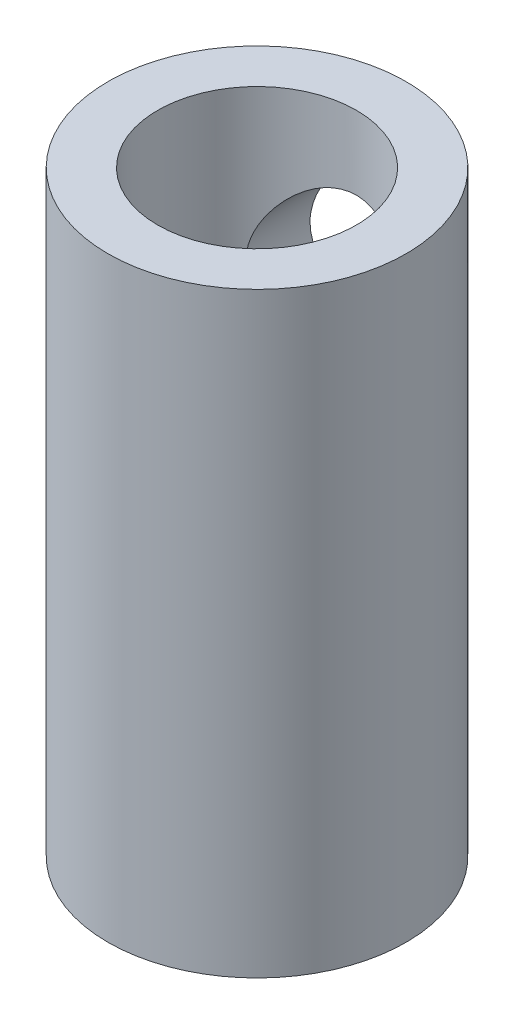
ISO-10303-21;
HEADER;
FILE_DESCRIPTION(('STEP AP214'),'2;1');
FILE_NAME('part.step','',(''),(''),'','','');
FILE_SCHEMA(('AUTOMOTIVE_DESIGN { 1 0 10303 214 1 1 1 1 }'));
ENDSEC;
DATA;
#1=APPLICATION_CONTEXT('core data for automotive mechanical design processes');
#2=APPLICATION_PROTOCOL_DEFINITION('international standard','automotive_design',2000,#1);
#3=PRODUCT_CONTEXT('',#1,'mechanical');
#4=PRODUCT('Part','Part','',(#3));
#5=PRODUCT_RELATED_PRODUCT_CATEGORY('part','',(#4));
#6=PRODUCT_DEFINITION_FORMATION('','',#4);
#7=PRODUCT_DEFINITION_CONTEXT('part definition',#1,'design');
#8=PRODUCT_DEFINITION('design','',#6,#7);
#9=PRODUCT_DEFINITION_SHAPE('','',#8);
#10=(LENGTH_UNIT() NAMED_UNIT(*) SI_UNIT(.MILLI.,.METRE.));
#11=(NAMED_UNIT(*) PLANE_ANGLE_UNIT() SI_UNIT($,.RADIAN.));
#12=(NAMED_UNIT(*) SI_UNIT($,.STERADIAN.) SOLID_ANGLE_UNIT());
#13=UNCERTAINTY_MEASURE_WITH_UNIT(LENGTH_MEASURE(1.E-05),#10,'distance_accuracy_value','');
#14=(GEOMETRIC_REPRESENTATION_CONTEXT(3) GLOBAL_UNCERTAINTY_ASSIGNED_CONTEXT((#13)) GLOBAL_UNIT_ASSIGNED_CONTEXT((#10,
#11,#12)) REPRESENTATION_CONTEXT('',''));
#15=CARTESIAN_POINT('',(0.,0.,0.));
#16=DIRECTION('',(0.,0.,1.));
#17=DIRECTION('',(1.,0.,0.));
#18=AXIS2_PLACEMENT_3D('',#15,#16,#17);
#19=CARTESIAN_POINT('',(0.,19.05,0.));
#20=DIRECTION('',(0.,-1.,0.));
#21=DIRECTION('',(0.,0.,-1.));
#22=AXIS2_PLACEMENT_3D('',#19,#20,#21);
#23=CYLINDRICAL_SURFACE('',#22,4.7625);
#24=CARTESIAN_POINT('',(0.,16.7005,-4.7625));
#25=CARTESIAN_POINT('',(-0.126649169989471,16.7004904991404,-4.76249188012535));
#26=CARTESIAN_POINT('',(-0.253448771240009,16.6904696086063,-4.75739362869145));
#27=CARTESIAN_POINT('',(-0.503284584888762,16.6508319787567,-4.7374986759061));
#28=CARTESIAN_POINT('',(-0.626313472406525,16.6211793513471,-4.72268421315245));
#29=CARTESIAN_POINT('',(-0.864618839509832,16.5437440782188,-4.68490559738032));
#30=CARTESIAN_POINT('',(-0.979923651751686,16.4960325082459,-4.66197341641602));
#31=CARTESIAN_POINT('',(-1.20071351455458,16.3842081989497,-4.61005152679328));
#32=CARTESIAN_POINT('',(-1.30619916940959,16.3200964698421,-4.58106219126309));
#33=CARTESIAN_POINT('',(-1.51166955891755,16.1728046436143,-4.51757958611899));
#34=CARTESIAN_POINT('',(-1.61091451989384,16.0886928212722,-4.48285720856476));
#35=CARTESIAN_POINT('',(-1.79457367080566,15.9057992768856,-4.41255032641904));
#36=CARTESIAN_POINT('',(-1.87897623231331,15.8070061634485,-4.37696517049107));
#37=CARTESIAN_POINT('',(-2.0373472926855,15.5880635759747,-4.30566577380489));
#38=CARTESIAN_POINT('',(-2.1099366693159,15.4668368942104,-4.27016993289307));
#39=CARTESIAN_POINT('',(-2.23339117146114,15.2119167320909,-4.20692439448885));
#40=CARTESIAN_POINT('',(-2.28427210991042,15.0782324129561,-4.17916906374952));
#41=CARTESIAN_POINT('',(-2.35950552281814,14.8104199580867,-4.13713770091992));
#42=CARTESIAN_POINT('',(-2.38527718275492,14.6768083587818,-4.12214753896866));
#43=CARTESIAN_POINT('',(-2.41389077594304,14.4063874633979,-4.10546522753346));
#44=CARTESIAN_POINT('',(-2.41675649067176,14.2695816317311,-4.10375928611473));
#45=CARTESIAN_POINT('',(-2.40051659080372,14.014851999874,-4.1132668070379));
#46=CARTESIAN_POINT('',(-2.38408320864943,13.8966846076081,-4.12290928369412));
#47=CARTESIAN_POINT('',(-2.33435392559415,13.6650893496392,-4.15126596463633));
#48=CARTESIAN_POINT('',(-2.30105240532798,13.5516630770086,-4.16998319194925));
#49=CARTESIAN_POINT('',(-2.2179405014121,13.3295284596641,-4.21478445246222));
#50=CARTESIAN_POINT('',(-2.16776471531076,13.2209908356282,-4.24102946061187));
#51=CARTESIAN_POINT('',(-2.05261226003203,13.0133481041773,-4.29794256082228));
#52=CARTESIAN_POINT('',(-1.98762893662852,12.9142472659503,-4.32861263914561));
#53=CARTESIAN_POINT('',(-1.83481041047057,12.7146586916941,-4.39576034471745));
#54=CARTESIAN_POINT('',(-1.74509874440939,12.6156817401138,-4.43247317271855));
#55=CARTESIAN_POINT('',(-1.55022377726655,12.4335381355665,-4.50433131719932));
#56=CARTESIAN_POINT('',(-1.44505275505379,12.3503794308669,-4.53947583889224));
#57=CARTESIAN_POINT('',(-1.21574956455372,12.1984004541145,-4.60633119632519));
#58=CARTESIAN_POINT('',(-1.09094195977516,12.1304794627845,-4.63779030658668));
#59=CARTESIAN_POINT('',(-0.829676205999801,12.0171621907337,-4.69156395583514));
#60=CARTESIAN_POINT('',(-0.693227645922141,11.97174757702,-4.71388593505582));
#61=CARTESIAN_POINT('',(-0.424880869717558,11.9085473594777,-4.74526824548201));
#62=CARTESIAN_POINT('',(-0.293568483964219,11.8887556348283,-4.75528777608905));
#63=CARTESIAN_POINT('',(-0.0291243143990887,11.8710449528576,-4.7642444807732));
#64=CARTESIAN_POINT('',(0.104006540109431,11.8731152123103,-4.76318711842965));
#65=CARTESIAN_POINT('',(0.356966618113464,11.8979397183137,-4.75065721618122));
#66=CARTESIAN_POINT('',(0.477007494648107,11.9190248414188,-4.74002523922596));
#67=CARTESIAN_POINT('',(0.71159599564283,11.9786364126619,-4.71052219175233));
#68=CARTESIAN_POINT('',(0.826143020149534,12.0171647609042,-4.69165022365322));
#69=CARTESIAN_POINT('',(1.0502184657147,12.1115384302354,-4.64670633277272));
#70=CARTESIAN_POINT('',(1.15951663148593,12.1678383268866,-4.6204476447536));
#71=CARTESIAN_POINT('',(1.36746797186693,12.2956382537828,-4.5632321095873));
#72=CARTESIAN_POINT('',(1.46611664357035,12.367144676118,-4.53227328830131));
#73=CARTESIAN_POINT('',(1.66045566146343,12.5315842509396,-4.46496330080072));
#74=CARTESIAN_POINT('',(1.75485954041948,12.6259463115136,-4.42838263537785));
#75=CARTESIAN_POINT('',(1.9270898372021,12.829193948083,-4.35619895996272));
#76=CARTESIAN_POINT('',(2.00490402365912,12.9380901443887,-4.32059668805824));
#77=CARTESIAN_POINT('',(2.14557932835793,13.1744291614423,-4.25256664834518));
#78=CARTESIAN_POINT('',(2.20745276695422,13.302541860622,-4.2204001369157));
#79=CARTESIAN_POINT('',(2.30810110834239,13.5695050123624,-4.16622004449994));
#80=CARTESIAN_POINT('',(2.34690652223803,13.7083410056377,-4.14419306113273));
#81=CARTESIAN_POINT('',(2.39667650984358,13.9784637313891,-4.11559214708887));
#82=CARTESIAN_POINT('',(2.40997137139681,14.1091813411489,-4.10772935866686));
#83=CARTESIAN_POINT('',(2.41510017437088,14.3711582181978,-4.10471909269506));
#84=CARTESIAN_POINT('',(2.4069442874578,14.5024171993046,-4.10956558856468));
#85=CARTESIAN_POINT('',(2.37159568724449,14.7478572653512,-4.13004566827807));
#86=CARTESIAN_POINT('',(2.34639260758052,14.8624315948009,-4.14454958002308));
#87=CARTESIAN_POINT('',(2.28017249089328,15.0855838438212,-4.18134498961912));
#88=CARTESIAN_POINT('',(2.23915025195246,15.1941597774588,-4.20363904892869));
#89=CARTESIAN_POINT('',(2.13939345773968,15.4102961497647,-4.25532018371052));
#90=CARTESIAN_POINT('',(2.07965672169698,15.5173016567959,-4.28508228026456));
#91=CARTESIAN_POINT('',(1.94525312330718,15.7204744805212,-4.3477460940319));
#92=CARTESIAN_POINT('',(1.87057839137304,15.8166360425107,-4.38064946132293));
#93=CARTESIAN_POINT('',(1.69738591796993,16.0080004561082,-4.45084946272285));
#94=CARTESIAN_POINT('',(1.59704956387471,16.1015562027459,-4.48817732929177));
#95=CARTESIAN_POINT('',(1.38114473626408,16.2708948808107,-4.5592523480188));
#96=CARTESIAN_POINT('',(1.26556783339425,16.3466679119008,-4.59299749984119));
#97=CARTESIAN_POINT('',(1.02029109479322,16.4786409706046,-4.65364913111884));
#98=CARTESIAN_POINT('',(0.890460384053465,16.5346355394081,-4.68048308272042));
#99=CARTESIAN_POINT('',(0.68901766141954,16.6011203275397,-4.71288867099249));
#100=CARTESIAN_POINT('',(0.620803069455487,16.6203568707864,-4.72237914990017));
#101=CARTESIAN_POINT('',(0.482637383587707,16.6528018302842,-4.73848995321273));
#102=CARTESIAN_POINT('',(0.412687358330087,16.6660138637106,-4.74511199973301));
#103=CARTESIAN_POINT('',(0.285633171872795,16.6842161874544,-4.75426521816766));
#104=CARTESIAN_POINT('',(0.228724551392877,16.6903157530033,-4.75734644572558));
#105=CARTESIAN_POINT('',(0.114554221734785,16.6984598633148,-4.761465700995));
#106=CARTESIAN_POINT('',(0.0572925030071179,16.7005042979202,-4.76250367320167));
#107=CARTESIAN_POINT('',(0.,16.7005,-4.7625));
#108=B_SPLINE_CURVE_WITH_KNOTS('',3,(#24,#25,#26,#27,#28,#29,#30,#31,#32,#33,#34,#35,#36,#37,
#38,#39,#40,#41,#42,#43,#44,#45,#46,#47,#48,#49,#50,#51,#52,#53,#54,#55,#56,#57,#58,#59,#60,#61,
#62,#63,#64,#65,#66,#67,#68,#69,#70,#71,#72,#73,#74,#75,#76,#77,#78,#79,#80,#81,#82,#83,#84,#85,
#86,#87,#88,#89,#90,#91,#92,#93,#94,#95,#96,#97,#98,#99,#100,#101,#102,#103,#104,#105,#106,
#107),.UNSPECIFIED.,.T.,.F.,(4,2,2,2,2,2,2,2,2,2,2,2,2,2,2,2,2,2,2,2,2,2,2,2,2,2,2,2,2,2,2,2,2,
2,2,2,2,2,2,2,2,4),(0.,0.37972493875304,0.760145963260223,1.13908505180002,1.51800080410008,
1.92027098436035,2.32285493659159,2.75771654448942,3.19226084595142,3.60050561015404,
4.00832647015917,4.36573385249239,4.72326037807563,5.08908918981097,5.45508272341639,
5.86889911452435,6.28292289174841,6.71717919099467,7.15108117479049,7.54841100478899,
7.94554486459919,8.31088619266214,8.67626732722213,9.05187688113557,9.42764463638961,
9.84105781272571,10.2547747472459,10.6899997657243,11.1246478421442,11.5172452764923,
11.9096565798085,12.2627433690108,12.6159463651959,12.9928025249141,13.3698577441264,
13.7944166296879,14.2192113260918,14.6482972916874,14.862546490938,15.0766668829149,
15.2484390409036,15.4202158650012),.UNSPECIFIED.);
#109=CARTESIAN_POINT('',(0.,16.7005,-4.7625));
#110=VERTEX_POINT('',#109);
#111=EDGE_CURVE('E82',#110,#110,#108,.T.);
#112=ORIENTED_EDGE('',*,*,#111,.T.);
#113=EDGE_LOOP('',(#112));
#114=FACE_BOUND('',#113,.T.);
#115=CARTESIAN_POINT('',(0.,7.1755,-4.7625));
#116=CARTESIAN_POINT('',(-0.126649169989471,7.17549049914035,-4.76249188012535));
#117=CARTESIAN_POINT('',(-0.25344877124001,7.16546960860626,-4.75739362869145));
#118=CARTESIAN_POINT('',(-0.503284584888762,7.1258319787567,-4.7374986759061));
#119=CARTESIAN_POINT('',(-0.626313472406526,7.09617935134709,-4.72268421315245));
#120=CARTESIAN_POINT('',(-0.864618839509832,7.01874407821883,-4.68490559738032));
#121=CARTESIAN_POINT('',(-0.979923651751686,6.97103250824591,-4.66197341641602));
#122=CARTESIAN_POINT('',(-1.20071351455458,6.85920819894971,-4.61005152679328));
#123=CARTESIAN_POINT('',(-1.30619916940959,6.79509646984207,-4.58106219126309));
#124=CARTESIAN_POINT('',(-1.51166955891755,6.64780464361434,-4.51757958611899));
#125=CARTESIAN_POINT('',(-1.61091451989384,6.56369282127221,-4.48285720856476));
#126=CARTESIAN_POINT('',(-1.79457367080566,6.3807992768856,-4.41255032641904));
#127=CARTESIAN_POINT('',(-1.87897623231331,6.28200616344853,-4.37696517049107));
#128=CARTESIAN_POINT('',(-2.0373472926855,6.0630635759747,-4.30566577380489));
#129=CARTESIAN_POINT('',(-2.1099366693159,5.94183689421039,-4.27016993289307));
#130=CARTESIAN_POINT('',(-2.23339117146114,5.68691673209092,-4.20692439448885));
#131=CARTESIAN_POINT('',(-2.28427210991042,5.55323241295608,-4.17916906374952));
#132=CARTESIAN_POINT('',(-2.35950552281814,5.28541995808668,-4.13713770091992));
#133=CARTESIAN_POINT('',(-2.38527718275492,5.1518083587818,-4.12214753896866));
#134=CARTESIAN_POINT('',(-2.41389077594304,4.88138746339789,-4.10546522753346));
#135=CARTESIAN_POINT('',(-2.41675649067176,4.74458163173105,-4.10375928611473));
#136=CARTESIAN_POINT('',(-2.40051659080372,4.48985199987396,-4.1132668070379));
#137=CARTESIAN_POINT('',(-2.38408320864943,4.37168460760806,-4.12290928369412));
#138=CARTESIAN_POINT('',(-2.33435392559415,4.14008934963915,-4.15126596463633));
#139=CARTESIAN_POINT('',(-2.30105240532798,4.02666307700856,-4.16998319194925));
#140=CARTESIAN_POINT('',(-2.2179405014121,3.80452845966411,-4.21478445246222));
#141=CARTESIAN_POINT('',(-2.16776471531076,3.69599083562822,-4.24102946061187));
#142=CARTESIAN_POINT('',(-2.05261226003203,3.48834810417733,-4.29794256082228));
#143=CARTESIAN_POINT('',(-1.98762893662852,3.38924726595025,-4.32861263914561));
#144=CARTESIAN_POINT('',(-1.83481041047057,3.18965869169409,-4.39576034471745));
#145=CARTESIAN_POINT('',(-1.74509874440939,3.09068174011378,-4.43247317271855));
#146=CARTESIAN_POINT('',(-1.55022377726655,2.90853813556645,-4.50433131719932));
#147=CARTESIAN_POINT('',(-1.44505275505379,2.82537943086688,-4.53947583889224));
#148=CARTESIAN_POINT('',(-1.21574956455372,2.67340045411453,-4.60633119632519));
#149=CARTESIAN_POINT('',(-1.09094195977516,2.60547946278453,-4.63779030658668));
#150=CARTESIAN_POINT('',(-0.829676205999801,2.49216219073375,-4.69156395583514));
#151=CARTESIAN_POINT('',(-0.693227645922141,2.44674757702004,-4.71388593505582));
#152=CARTESIAN_POINT('',(-0.424880869717557,2.38354735947771,-4.74526824548201));
#153=CARTESIAN_POINT('',(-0.293568483964219,2.36375563482829,-4.75528777608905));
#154=CARTESIAN_POINT('',(-0.0291243143990889,2.34604495285758,-4.7642444807732));
#155=CARTESIAN_POINT('',(0.104006540109431,2.34811521231032,-4.76318711842965));
#156=CARTESIAN_POINT('',(0.356966618113464,2.37293971831372,-4.75065721618122));
#157=CARTESIAN_POINT('',(0.477007494648107,2.39402484141882,-4.74002523922596));
#158=CARTESIAN_POINT('',(0.711595995642831,2.45363641266194,-4.71052219175233));
#159=CARTESIAN_POINT('',(0.826143020149534,2.49216476090419,-4.69165022365322));
#160=CARTESIAN_POINT('',(1.0502184657147,2.58653843023538,-4.64670633277272));
#161=CARTESIAN_POINT('',(1.15951663148593,2.64283832688658,-4.6204476447536));
#162=CARTESIAN_POINT('',(1.36746797186693,2.77063825378283,-4.5632321095873));
#163=CARTESIAN_POINT('',(1.46611664357035,2.84214467611803,-4.53227328830131));
#164=CARTESIAN_POINT('',(1.66045566146343,3.0065842509396,-4.46496330080072));
#165=CARTESIAN_POINT('',(1.75485954041948,3.10094631151358,-4.42838263537785));
#166=CARTESIAN_POINT('',(1.9270898372021,3.30419394808305,-4.35619895996272));
#167=CARTESIAN_POINT('',(2.00490402365912,3.41309014438869,-4.32059668805824));
#168=CARTESIAN_POINT('',(2.14557932835793,3.64942916144228,-4.25256664834518));
#169=CARTESIAN_POINT('',(2.20745276695422,3.77754186062205,-4.2204001369157));
#170=CARTESIAN_POINT('',(2.30810110834239,4.04450501236243,-4.16622004449994));
#171=CARTESIAN_POINT('',(2.34690652223803,4.18334100563769,-4.14419306113273));
#172=CARTESIAN_POINT('',(2.39667650984358,4.45346373138915,-4.11559214708887));
#173=CARTESIAN_POINT('',(2.40997137139681,4.58418134114891,-4.10772935866686));
#174=CARTESIAN_POINT('',(2.41510017437088,4.84615821819779,-4.10471909269507));
#175=CARTESIAN_POINT('',(2.4069442874578,4.97741719930457,-4.10956558856468));
#176=CARTESIAN_POINT('',(2.37159568724449,5.22285726535123,-4.13004566827807));
#177=CARTESIAN_POINT('',(2.34639260758052,5.33743159480093,-4.14454958002308));
#178=CARTESIAN_POINT('',(2.28017249089328,5.5605838438212,-4.18134498961912));
#179=CARTESIAN_POINT('',(2.23915025195246,5.66915977745885,-4.20363904892869));
#180=CARTESIAN_POINT('',(2.13939345773968,5.88529614976465,-4.25532018371052));
#181=CARTESIAN_POINT('',(2.07965672169698,5.99230165679589,-4.28508228026456));
#182=CARTESIAN_POINT('',(1.94525312330718,6.19547448052115,-4.3477460940319));
#183=CARTESIAN_POINT('',(1.87057839137305,6.29163604251073,-4.38064946132293));
#184=CARTESIAN_POINT('',(1.69738591796993,6.48300045610822,-4.45084946272285));
#185=CARTESIAN_POINT('',(1.59704956387471,6.57655620274594,-4.48817732929177));
#186=CARTESIAN_POINT('',(1.38114473626408,6.74589488081072,-4.5592523480188));
#187=CARTESIAN_POINT('',(1.26556783339424,6.82166791190082,-4.59299749984119));
#188=CARTESIAN_POINT('',(1.02029109479322,6.95364097060457,-4.65364913111884));
#189=CARTESIAN_POINT('',(0.890460384053465,7.00963553940805,-4.68048308272042));
#190=CARTESIAN_POINT('',(0.68901766141954,7.0761203275397,-4.71288867099249));
#191=CARTESIAN_POINT('',(0.620803069455486,7.09535687078643,-4.72237914990017));
#192=CARTESIAN_POINT('',(0.482637383587706,7.12780183028416,-4.73848995321273));
#193=CARTESIAN_POINT('',(0.412687358330087,7.14101386371059,-4.74511199973301));
#194=CARTESIAN_POINT('',(0.285633171872796,7.15921618745443,-4.75426521816766));
#195=CARTESIAN_POINT('',(0.228724551392878,7.16531575300326,-4.75734644572558));
#196=CARTESIAN_POINT('',(0.114554221734785,7.17345986331477,-4.761465700995));
#197=CARTESIAN_POINT('',(0.0572925030071181,7.17550429792023,-4.76250367320167));
#198=CARTESIAN_POINT('',(0.,7.1755,-4.7625));
#199=B_SPLINE_CURVE_WITH_KNOTS('',3,(#115,#116,#117,#118,#119,#120,#121,#122,#123,#124,#125,
#126,#127,#128,#129,#130,#131,#132,#133,#134,#135,#136,#137,#138,#139,#140,#141,#142,#143,#144,
#145,#146,#147,#148,#149,#150,#151,#152,#153,#154,#155,#156,#157,#158,#159,#160,#161,#162,#163,
#164,#165,#166,#167,#168,#169,#170,#171,#172,#173,#174,#175,#176,#177,#178,#179,#180,#181,#182,
#183,#184,#185,#186,#187,#188,#189,#190,#191,#192,#193,#194,#195,#196,#197,#198),.UNSPECIFIED.,
.T.,.F.,(4,2,2,2,2,2,2,2,2,2,2,2,2,2,2,2,2,2,2,2,2,2,2,2,2,2,2,2,2,2,2,2,2,2,2,2,2,2,2,2,2,4),
(0.,0.37972493875304,0.760145963260223,1.13908505180002,1.51800080410008,1.92027098436035,
2.3228549365916,2.75771654448942,3.19226084595142,3.60050561015404,4.00832647015917,
4.36573385249239,4.72326037807563,5.08908918981097,5.45508272341639,5.86889911452435,
6.28292289174841,6.71717919099467,7.15108117479049,7.54841100478899,7.94554486459919,
8.31088619266213,8.67626732722213,9.05187688113557,9.42764463638961,9.84105781272571,
10.2547747472458,10.6899997657243,11.1246478421442,11.5172452764923,11.9096565798085,
12.2627433690108,12.6159463651959,12.992802524914,13.3698577441264,13.7944166296879,
14.2192113260918,14.6482972916874,14.862546490938,15.0766668829149,15.2484390409036,
15.4202158650012),.UNSPECIFIED.);
#200=CARTESIAN_POINT('',(0.,7.1755,-4.7625));
#201=VERTEX_POINT('',#200);
#202=EDGE_CURVE('E71',#201,#201,#199,.T.);
#203=ORIENTED_EDGE('',*,*,#202,.T.);
#204=EDGE_LOOP('',(#203));
#205=FACE_BOUND('',#204,.T.);
#206=CARTESIAN_POINT('',(0.,19.05,0.));
#207=DIRECTION('',(0.,1.,0.));
#208=DIRECTION('',(0.,0.,1.));
#209=AXIS2_PLACEMENT_3D('',#206,#207,#208);
#210=CIRCLE('',#209,4.7625);
#211=CARTESIAN_POINT('',(0.,19.05,4.7625));
#212=VERTEX_POINT('',#211);
#213=EDGE_CURVE('E10',#212,#212,#210,.T.);
#214=ORIENTED_EDGE('',*,*,#213,.F.);
#215=EDGE_LOOP('',(#214));
#216=FACE_BOUND('',#215,.T.);
#217=CARTESIAN_POINT('',(0.,0.,0.));
#218=DIRECTION('',(0.,1.,0.));
#219=DIRECTION('',(0.,0.,1.));
#220=AXIS2_PLACEMENT_3D('',#217,#218,#219);
#221=CIRCLE('',#220,4.7625);
#222=CARTESIAN_POINT('',(0.,0.,4.7625));
#223=VERTEX_POINT('',#222);
#224=EDGE_CURVE('E51',#223,#223,#221,.T.);
#225=ORIENTED_EDGE('',*,*,#224,.T.);
#226=EDGE_LOOP('',(#225));
#227=FACE_BOUND('',#226,.T.);
#228=ADVANCED_FACE('F37',(#114,#205,#216,#227),#23,.T.);
#229=CARTESIAN_POINT('',(0.,19.05,0.));
#230=DIRECTION('',(0.,1.,0.));
#231=DIRECTION('',(0.,0.,1.));
#232=AXIS2_PLACEMENT_3D('',#229,#230,#231);
#233=PLANE('',#232);
#234=CARTESIAN_POINT('',(0.,19.05,0.));
#235=DIRECTION('',(0.,1.,0.));
#236=DIRECTION('',(0.,0.,1.));
#237=AXIS2_PLACEMENT_3D('',#234,#235,#236);
#238=CIRCLE('',#237,3.175);
#239=CARTESIAN_POINT('',(0.,19.05,3.175));
#240=VERTEX_POINT('',#239);
#241=EDGE_CURVE('E67',#240,#240,#238,.T.);
#242=ORIENTED_EDGE('',*,*,#241,.F.);
#243=EDGE_LOOP('',(#242));
#244=FACE_BOUND('',#243,.T.);
#245=ORIENTED_EDGE('',*,*,#213,.T.);
#246=EDGE_LOOP('',(#245));
#247=FACE_BOUND('',#246,.T.);
#248=ADVANCED_FACE('F122',(#244,#247),#233,.T.);
#249=CARTESIAN_POINT('',(0.,0.,0.));
#250=DIRECTION('',(0.,1.,0.));
#251=DIRECTION('',(0.,0.,1.));
#252=AXIS2_PLACEMENT_3D('',#249,#250,#251);
#253=PLANE('',#252);
#254=CARTESIAN_POINT('',(0.,0.,0.));
#255=DIRECTION('',(0.,-1.,0.));
#256=DIRECTION('',(0.,0.,-1.));
#257=AXIS2_PLACEMENT_3D('',#254,#255,#256);
#258=CIRCLE('',#257,3.);
#259=CARTESIAN_POINT('',(0.,0.,-3.));
#260=VERTEX_POINT('',#259);
#261=EDGE_CURVE('E57',#260,#260,#258,.T.);
#262=ORIENTED_EDGE('',*,*,#261,.F.);
#263=EDGE_LOOP('',(#262));
#264=FACE_BOUND('',#263,.T.);
#265=ORIENTED_EDGE('',*,*,#224,.F.);
#266=EDGE_LOOP('',(#265));
#267=FACE_BOUND('',#266,.T.);
#268=ADVANCED_FACE('F126',(#264,#267),#253,.F.);
#269=CARTESIAN_POINT('',(0.,9.525,0.));
#270=DIRECTION('',(0.,-1.,0.));
#271=DIRECTION('',(0.,0.,-1.));
#272=AXIS2_PLACEMENT_3D('',#269,#270,#271);
#273=CYLINDRICAL_SURFACE('',#272,3.);
#274=CARTESIAN_POINT('',(-2.413,4.7625,-1.78253499264391));
#275=CARTESIAN_POINT('',(-2.41299430743445,4.67258031783159,-1.78254851108404));
#276=CARTESIAN_POINT('',(-2.40791485505805,4.58250432740654,-1.78948097817773));
#277=CARTESIAN_POINT('',(-2.38808345058082,4.40520929452183,-1.81584842282776));
#278=CARTESIAN_POINT('',(-2.37329938863634,4.31800074903126,-1.83532490097093));
#279=CARTESIAN_POINT('',(-2.32838878000464,4.11825936602549,-1.89217193978176));
#280=CARTESIAN_POINT('',(-2.29468610088641,4.00767226927371,-1.9334342456613));
#281=CARTESIAN_POINT('',(-2.21379961347961,3.7957491117013,-2.02555003805021));
#282=CARTESIAN_POINT('',(-2.16657656353706,3.69444112910571,-2.07643129450142));
#283=CARTESIAN_POINT('',(-2.07665948749543,3.53133147539752,-2.1656776874194));
#284=CARTESIAN_POINT('',(-2.03719773883297,3.46711183661053,-2.20295744482445));
#285=CARTESIAN_POINT('',(-1.9526757579899,3.34289544055459,-2.2782153354572));
#286=CARTESIAN_POINT('',(-1.90761347086337,3.28290024603976,-2.31619372064442));
#287=CARTESIAN_POINT('',(-1.76423363773395,3.109461367576,-2.42945509221245));
#288=CARTESIAN_POINT('',(-1.65758179162862,3.00230900224993,-2.50421259442698));
#289=CARTESIAN_POINT('',(-1.44615979012903,2.82701841938569,-2.63071747154032));
#290=CARTESIAN_POINT('',(-1.34525258253043,2.7553609819688,-2.68408107520287));
#291=CARTESIAN_POINT('',(-1.13028181937375,2.62693391217924,-2.78142252711402));
#292=CARTESIAN_POINT('',(-1.01623920198195,2.57014104560873,-2.82541500270635));
#293=CARTESIAN_POINT('',(-0.796428887883768,2.48216942276475,-2.89425708531859));
#294=CARTESIAN_POINT('',(-0.692345870978517,2.44832363927268,-2.92105872326036));
#295=CARTESIAN_POINT('',(-0.478397743977265,2.39483533224658,-2.96361284104196));
#296=CARTESIAN_POINT('',(-0.368535854846743,2.37518498474626,-2.97937140724517));
#297=CARTESIAN_POINT('',(-0.14565914701271,2.35128611396211,-2.99855495660367));
#298=CARTESIAN_POINT('',(-0.0326345542978043,2.34709228995057,-3.0019361369989));
#299=CARTESIAN_POINT('',(0.192544812149894,2.35455776322154,-2.99593254359604));
#300=CARTESIAN_POINT('',(0.304699555057348,2.36621761976125,-2.98654731944803));
#301=CARTESIAN_POINT('',(0.518470111959466,2.40350060443994,-2.95672013379574));
#302=CARTESIAN_POINT('',(0.620324247576274,2.4283041626115,-2.93692762333519));
#303=CARTESIAN_POINT('',(0.817943049723856,2.48999819299224,-2.88813780009708));
#304=CARTESIAN_POINT('',(0.91370615744772,2.52689174451151,-2.85913814232632));
#305=CARTESIAN_POINT('',(1.10643203783422,2.6152539879367,-2.79056349046066));
#306=CARTESIAN_POINT('',(1.20264250067165,2.66777525014609,-2.75024496128841));
#307=CARTESIAN_POINT('',(1.38502722464961,2.78362174879347,-2.66306875686147));
#308=CARTESIAN_POINT('',(1.47119606267212,2.84695277810947,-2.61620757791065));
#309=CARTESIAN_POINT('',(1.64983831002843,2.99702810953549,-2.50819701693069));
#310=CARTESIAN_POINT('',(1.73993915312148,3.08590667235617,-2.44609539175895));
#311=CARTESIAN_POINT('',(1.90483683136307,3.27588544793514,-2.31999399168735));
#312=CARTESIAN_POINT('',(1.97961384780714,3.37700122205726,-2.25599187973017));
#313=CARTESIAN_POINT('',(2.10771350648034,3.5820406277629,-2.13648074066135));
#314=CARTESIAN_POINT('',(2.16231111802916,3.68501397182376,-2.0807100023959));
#315=CARTESIAN_POINT('',(2.25713849785662,3.90123867744617,-1.97742567724112));
#316=CARTESIAN_POINT('',(2.29739963024274,4.01446691446633,-1.92989418371491));
#317=CARTESIAN_POINT('',(2.35131845024615,4.21392837169281,-1.86347505996856));
#318=CARTESIAN_POINT('',(2.3693590896359,4.29750499684702,-1.84027885101359));
#319=CARTESIAN_POINT('',(2.39654640379945,4.46827107904827,-1.80473757834436));
#320=CARTESIAN_POINT('',(2.40571352329159,4.55545174632916,-1.79236757722895));
#321=CARTESIAN_POINT('',(2.4144253969145,4.73177334449569,-1.78062290254389));
#322=CARTESIAN_POINT('',(2.41390927736139,4.82092315500118,-1.78133044051318));
#323=CARTESIAN_POINT('',(2.40315631476085,4.99759881873174,-1.79580235552103));
#324=CARTESIAN_POINT('',(2.39290621145667,5.08512229060314,-1.80958454365978));
#325=CARTESIAN_POINT('',(2.35999209766829,5.27694673168642,-1.85237990449067));
#326=CARTESIAN_POINT('',(2.33491836229512,5.38016198568649,-1.88427854935846));
#327=CARTESIAN_POINT('',(2.27301708574988,5.57913479627566,-1.95849789456295));
#328=CARTESIAN_POINT('',(2.23615405643569,5.67486873574864,-2.00084997283333));
#329=CARTESIAN_POINT('',(2.16302478034027,5.83462363201456,-2.07928185065524));
#330=CARTESIAN_POINT('',(2.12912757853383,5.90038677734992,-2.11410204292512));
#331=CARTESIAN_POINT('',(2.05589604106465,6.02791372576647,-2.18538365975819));
#332=CARTESIAN_POINT('',(2.01655937219534,6.08967579584094,-2.22184578406189));
#333=CARTESIAN_POINT('',(1.93257336951637,6.20924319805072,-2.29527172470882));
#334=CARTESIAN_POINT('',(1.88792036819741,6.26704575487376,-2.33223587161903));
#335=CARTESIAN_POINT('',(1.79340091016875,6.3785550934517,-2.40568283403059));
#336=CARTESIAN_POINT('',(1.7435317765776,6.43225974750002,-2.44216539146097));
#337=CARTESIAN_POINT('',(1.58435087623979,6.58862477889727,-2.55077221093352));
#338=CARTESIAN_POINT('',(1.46675739675374,6.6846801045317,-2.62086837226595));
#339=CARTESIAN_POINT('',(1.27522019214262,6.81244145913684,-2.71641699735606));
#340=CARTESIAN_POINT('',(1.20890975466684,6.85228263603011,-2.74664666798879));
#341=CARTESIAN_POINT('',(1.07145509098417,6.92597637014361,-2.8031223524527));
#342=CARTESIAN_POINT('',(1.00031360171925,6.95983227966875,-2.82937059507553));
#343=CARTESIAN_POINT('',(0.827433751507297,7.03175570344284,-2.88552966518416));
#344=CARTESIAN_POINT('',(0.723829446901857,7.06702152497197,-2.91341002475666));
#345=CARTESIAN_POINT('',(0.510610596478723,7.12342955733278,-2.95823010410423));
#346=CARTESIAN_POINT('',(0.401000735477447,7.14458261218228,-2.97517822369975));
#347=CARTESIAN_POINT('',(0.178231721381846,7.17153060552272,-2.99679714910096));
#348=CARTESIAN_POINT('',(0.0650603272508414,7.1772649451886,-3.00141951147537));
#349=CARTESIAN_POINT('',(-0.16076046223047,7.17278608917623,-2.99781723033239));
#350=CARTESIAN_POINT('',(-0.273409842051129,7.16257242206948,-2.98959220704191));
#351=CARTESIAN_POINT('',(-0.488120864730353,7.12796931130198,-2.96188754726469));
#352=CARTESIAN_POINT('',(-0.59041592783132,7.10444674154096,-2.94309654986724));
#353=CARTESIAN_POINT('',(-0.789110074696381,7.04518124498723,-2.89615922585204));
#354=CARTESIAN_POINT('',(-0.88550761386845,7.00943513280156,-2.8680104607009));
#355=CARTESIAN_POINT('',(-1.07899256438706,6.92363645986735,-2.80127640445485));
#356=CARTESIAN_POINT('',(-1.17539988565041,6.87260456858098,-2.76199261179301));
#357=CARTESIAN_POINT('',(-1.35838314274924,6.75973271736124,-2.67675205778911));
#358=CARTESIAN_POINT('',(-1.44495438446663,6.69788763244399,-2.63079213400657));
#359=CARTESIAN_POINT('',(-1.6244042754742,6.55132691644141,-2.52472950925042));
#360=CARTESIAN_POINT('',(-1.7149915533042,6.46451747051505,-2.46365045504718));
#361=CARTESIAN_POINT('',(-1.88119309981082,6.27882558295143,-2.33920868843212));
#362=CARTESIAN_POINT('',(-1.95678650902517,6.1799266270926,-2.27584293752944));
#363=CARTESIAN_POINT('',(-2.08927939385767,5.97559813076548,-2.15466171698097));
#364=CARTESIAN_POINT('',(-2.14690153752136,5.87070925838683,-2.09672580657746));
#365=CARTESIAN_POINT('',(-2.2470961520863,5.65005137098701,-1.98895460258892));
#366=CARTESIAN_POINT('',(-2.28969714074973,5.53430350682665,-1.93910405716193));
#367=CARTESIAN_POINT('',(-2.34684220491015,5.33023095192491,-1.86914556012343));
#368=CARTESIAN_POINT('',(-2.36599689021046,5.24474433921005,-1.84461479530682));
#369=CARTESIAN_POINT('',(-2.39496385594399,5.06989435547491,-1.80685786664069));
#370=CARTESIAN_POINT('',(-2.40481210423824,4.98054731702533,-1.79358820093606));
#371=CARTESIAN_POINT('',(-2.41073162463597,4.86927923855425,-1.78560159044096));
#372=CARTESIAN_POINT('',(-2.41158092729565,4.84795236756305,-1.78445472778669));
#373=CARTESIAN_POINT('',(-2.41271584131613,4.80525328176475,-1.78291975498661));
#374=CARTESIAN_POINT('',(-2.41300135357555,4.78388105964678,-1.78253177823558));
#375=CARTESIAN_POINT('',(-2.413,4.7625,-1.78253499264391));
#376=B_SPLINE_CURVE_WITH_KNOTS('',3,(#274,#275,#276,#277,#278,#279,#280,#281,#282,#283,#284,
#285,#286,#287,#288,#289,#290,#291,#292,#293,#294,#295,#296,#297,#298,#299,#300,#301,#302,#303,
#304,#305,#306,#307,#308,#309,#310,#311,#312,#313,#314,#315,#316,#317,#318,#319,#320,#321,#322,
#323,#324,#325,#326,#327,#328,#329,#330,#331,#332,#333,#334,#335,#336,#337,#338,#339,#340,#341,
#342,#343,#344,#345,#346,#347,#348,#349,#350,#351,#352,#353,#354,#355,#356,#357,#358,#359,#360,
#361,#362,#363,#364,#365,#366,#367,#368,#369,#370,#371,#372,#373,#374,#375),.UNSPECIFIED.,.T.,
.F.,(4,2,2,2,2,2,2,2,2,2,2,2,2,2,2,2,2,2,2,2,2,2,2,2,2,2,2,2,2,2,2,2,2,2,2,2,2,2,2,2,2,2,2,2,2,
2,2,2,2,2,4),(0.,0.269664563763873,0.540225900370231,0.90643142852592,1.27371080120684,
1.52568802942088,1.77775798742868,2.28092709298978,2.68379348090293,3.08602635274483,
3.42264667079348,3.75908131510789,4.09670543489133,4.43434146507116,4.75304640779462,
5.07183258754489,5.42094124282901,5.77023757375612,6.19166392007547,6.61363191528356,
7.00013425524371,7.3857857673874,7.65061264135253,7.91482788767167,8.1807046766231,
8.44694418033308,8.77782272160043,9.10970679976915,9.35472636516769,9.59985135723955,
9.84514644115199,10.0905680321805,10.5889892881923,10.837797382389,11.0864656763979,
11.4237880366374,11.76085090449,12.0992365778342,12.4376322541633,12.7561737296252,
13.0747982787149,13.4213498983061,13.7680662157638,14.1852171468329,14.6029444091928,
15.0006380543955,15.3975725579911,15.6695486670438,15.9404692812302,16.0045787261475,
16.0686994390262),.UNSPECIFIED.);
#377=CARTESIAN_POINT('',(-2.413,4.7625,-1.78253499264391));
#378=VERTEX_POINT('',#377);
#379=EDGE_CURVE('E97',#378,#378,#376,.T.);
#380=ORIENTED_EDGE('',*,*,#379,.F.);
#381=EDGE_LOOP('',(#380));
#382=FACE_BOUND('',#381,.T.);
#383=CARTESIAN_POINT('',(0.,9.525,0.));
#384=DIRECTION('',(0.,-1.,0.));
#385=DIRECTION('',(0.,0.,-1.));
#386=AXIS2_PLACEMENT_3D('',#383,#384,#385);
#387=CIRCLE('',#386,3.);
#388=CARTESIAN_POINT('',(0.,9.525,-3.));
#389=VERTEX_POINT('',#388);
#390=EDGE_CURVE('E62',#389,#389,#387,.T.);
#391=ORIENTED_EDGE('',*,*,#390,.F.);
#392=EDGE_LOOP('',(#391));
#393=FACE_BOUND('',#392,.T.);
#394=ORIENTED_EDGE('',*,*,#261,.T.);
#395=EDGE_LOOP('',(#394));
#396=FACE_BOUND('',#395,.T.);
#397=ADVANCED_FACE('F132',(#382,#393,#396),#273,.F.);
#398=CARTESIAN_POINT('',(0.,9.525,0.));
#399=DIRECTION('',(0.,1.,0.));
#400=DIRECTION('',(0.,0.,1.));
#401=AXIS2_PLACEMENT_3D('',#398,#399,#400);
#402=PLANE('',#401);
#403=CARTESIAN_POINT('',(0.,9.525,0.));
#404=DIRECTION('',(0.,1.,0.));
#405=DIRECTION('',(0.,0.,1.));
#406=AXIS2_PLACEMENT_3D('',#403,#404,#405);
#407=CIRCLE('',#406,3.175);
#408=CARTESIAN_POINT('',(0.,9.525,3.175));
#409=VERTEX_POINT('',#408);
#410=EDGE_CURVE('E66',#409,#409,#407,.T.);
#411=ORIENTED_EDGE('',*,*,#410,.T.);
#412=EDGE_LOOP('',(#411));
#413=FACE_BOUND('',#412,.T.);
#414=ORIENTED_EDGE('',*,*,#390,.T.);
#415=EDGE_LOOP('',(#414));
#416=FACE_BOUND('',#415,.T.);
#417=ADVANCED_FACE('F95',(#413,#416),#402,.T.);
#418=CARTESIAN_POINT('',(0.,9.525,0.));
#419=DIRECTION('',(0.,1.,0.));
#420=DIRECTION('',(0.,0.,1.));
#421=AXIS2_PLACEMENT_3D('',#418,#419,#420);
#422=CYLINDRICAL_SURFACE('',#421,3.175);
#423=CARTESIAN_POINT('',(-2.413,14.2875,-2.06350575477753));
#424=CARTESIAN_POINT('',(-2.41300384876277,14.3434977586079,-2.06349766555223));
#425=CARTESIAN_POINT('',(-2.41104636641706,14.3994698984346,-2.06579659278864));
#426=CARTESIAN_POINT('',(-2.40329389496792,14.5107969323125,-2.07481059221271));
#427=CARTESIAN_POINT('',(-2.39749800478207,14.5661516783244,-2.0815267013499));
#428=CARTESIAN_POINT('',(-2.37452643031283,14.730730930903,-2.10779766430809));
#429=CARTESIAN_POINT('',(-2.3517677822974,14.8382423182119,-2.13347267357547));
#430=CARTESIAN_POINT('',(-2.28722351646808,15.0673835998928,-2.20269111734984));
#431=CARTESIAN_POINT('',(-2.24247550670671,15.1873324493421,-2.24883240950117));
#432=CARTESIAN_POINT('',(-2.13665555670058,15.4158409097984,-2.34961419483324));
#433=CARTESIAN_POINT('',(-2.07556237163149,15.5243854403583,-2.40426571035331));
#434=CARTESIAN_POINT('',(-1.93671110131199,15.7323949414307,-2.51753950718917));
#435=CARTESIAN_POINT('',(-1.85859103135989,15.8315823699681,-2.57622533251206));
#436=CARTESIAN_POINT('',(-1.68723666299453,16.0171589155479,-2.69156414414368));
#437=CARTESIAN_POINT('',(-1.59401525841436,16.1035588314548,-2.74821881473489));
#438=CARTESIAN_POINT('',(-1.39716607676683,16.2586748913667,-2.85315208859149));
#439=CARTESIAN_POINT('',(-1.2941428949445,16.3279831040856,-2.90168315757866));
#440=CARTESIAN_POINT('',(-1.07549217884956,16.4511940617873,-2.98960954011671));
#441=CARTESIAN_POINT('',(-0.95986728921893,16.505100030576,-3.02900676512403));
#442=CARTESIAN_POINT('',(-0.778268848078234,16.5724747928511,-3.07878885025568));
#443=CARTESIAN_POINT('',(-0.716030885125077,16.5927552639036,-3.09388429687943));
#444=CARTESIAN_POINT('',(-0.589412014064372,16.628328554238,-3.12047961644454));
#445=CARTESIAN_POINT('',(-0.525032304612982,16.6436241133089,-3.13198146434221));
#446=CARTESIAN_POINT('',(-0.394715052210577,16.6689217509782,-3.1510564017467));
#447=CARTESIAN_POINT('',(-0.328778746270046,16.6789278942868,-3.15863250794454));
#448=CARTESIAN_POINT('',(-0.195988271218936,16.6934563486708,-3.16964684540275));
#449=CARTESIAN_POINT('',(-0.129134271473168,16.6979796582267,-3.17308583007457));
#450=CARTESIAN_POINT('',(0.0511841549175347,16.702609365827,-3.17660105133782));
#451=CARTESIAN_POINT('',(0.1649280944518,16.6975023046015,-3.17271037795875));
#452=CARTESIAN_POINT('',(0.389465719923914,16.6715485399462,-3.15304234409858));
#453=CARTESIAN_POINT('',(0.500259351245261,16.6507015453461,-3.13726476372362));
#454=CARTESIAN_POINT('',(0.712564981379427,16.5954166199781,-3.09583787288464));
#455=CARTESIAN_POINT('',(0.814259116450559,16.5614255576762,-3.0705137691396));
#456=CARTESIAN_POINT('',(1.01022655006776,16.4814070329983,-3.01173516184104));
#457=CARTESIAN_POINT('',(1.10449854806913,16.4353774672543,-2.97827923756766));
#458=CARTESIAN_POINT('',(1.2963855816043,16.3260553190578,-2.90036167852794));
#459=CARTESIAN_POINT('',(1.39280110339089,16.2612864651979,-2.85503040793757));
#460=CARTESIAN_POINT('',(1.57395461804203,16.1201076996671,-2.75931376891235));
#461=CARTESIAN_POINT('',(1.65867875852527,16.0436842009398,-2.70892252525813));
#462=CARTESIAN_POINT('',(1.83208498557192,15.8637906719484,-2.59555011449966));
#463=CARTESIAN_POINT('',(1.91804120273241,15.7579845942823,-2.53209961613442));
#464=CARTESIAN_POINT('',(2.07166543974386,15.5322533153767,-2.40801586026499));
#465=CARTESIAN_POINT('',(2.13933686929979,15.412330752543,-2.34738207925457));
#466=CARTESIAN_POINT('',(2.23852597032697,15.1939528302548,-2.25232386515265));
#467=CARTESIAN_POINT('',(2.27486341741354,15.0988290159626,-2.2153044738989));
#468=CARTESIAN_POINT('',(2.33575807059808,14.9018096872838,-2.15100626217277));
#469=CARTESIAN_POINT('',(2.36034336047521,14.7999309856615,-2.12370426066709));
#470=CARTESIAN_POINT('',(2.39332860368184,14.6076341418612,-2.0864164460846));
#471=CARTESIAN_POINT('',(2.4036781723044,14.5179635921817,-2.07436996737503));
#472=CARTESIAN_POINT('',(2.41418029529457,14.337243143386,-2.06214302897627));
#473=CARTESIAN_POINT('',(2.41434122945455,14.2461944394098,-2.06195281792722));
#474=CARTESIAN_POINT('',(2.40447669888359,14.0656140661536,-2.07344242444912));
#475=CARTESIAN_POINT('',(2.39446905399602,13.9760800215891,-2.08510147688318));
#476=CARTESIAN_POINT('',(2.36502018244623,13.8004600280257,-2.11844014559027));
#477=CARTESIAN_POINT('',(2.34556334164156,13.7143800424037,-2.14013634473028));
#478=CARTESIAN_POINT('',(2.28704796361355,13.5075230483991,-2.2028649637028));
#479=CARTESIAN_POINT('',(2.24307446157911,13.3894599907125,-2.24819256805863));
#480=CARTESIAN_POINT('',(2.13926887967049,13.1643168389702,-2.34719282237522));
#481=CARTESIAN_POINT('',(2.07940154551663,13.0572619036501,-2.40088391269594));
#482=CARTESIAN_POINT('',(1.94248178332443,12.8503890186222,-2.51307238577684));
#483=CARTESIAN_POINT('',(1.8648563817886,12.7510084805915,-2.57167523175722));
#484=CARTESIAN_POINT('',(1.69452086117817,12.5649871212837,-2.68696847527322));
#485=CARTESIAN_POINT('',(1.60182266550314,12.4783363323839,-2.74366034204564));
#486=CARTESIAN_POINT('',(1.40556091515507,12.3222836985766,-2.8490279242683));
#487=CARTESIAN_POINT('',(1.30254084190403,12.2523534622306,-2.89792571338472));
#488=CARTESIAN_POINT('',(1.08391773620375,12.1279961904291,-2.98657218651874));
#489=CARTESIAN_POINT('',(0.968326619943808,12.0735546471489,-3.02632942548936));
#490=CARTESIAN_POINT('',(0.744820790949121,11.9897079958714,-3.08824129901619));
#491=CARTESIAN_POINT('',(0.638342844005635,11.9577764305382,-3.11213912947554));
#492=CARTESIAN_POINT('',(0.420195997446263,11.9087448819583,-3.14901056969517));
#493=CARTESIAN_POINT('',(0.30853042733191,11.8916355204376,-3.16199108688333));
#494=CARTESIAN_POINT('',(0.082821918416499,11.8732585119427,-3.17593786628277));
#495=CARTESIAN_POINT('',(-0.0312267824469698,11.8720351821775,-3.17687051856814));
#496=CARTESIAN_POINT('',(-0.257805395090509,11.8856277524187,-3.16654814979771));
#497=CARTESIAN_POINT('',(-0.370335074323581,11.9004460806697,-3.15529128360007));
#498=CARTESIAN_POINT('',(-0.585939055253849,11.9442435292315,-3.12229262692281));
#499=CARTESIAN_POINT('',(-0.689211971147495,11.9726059927632,-3.10100791737993));
#500=CARTESIAN_POINT('',(-0.889151757299805,12.0417971223986,-3.04970488248075));
#501=CARTESIAN_POINT('',(-0.985817154713663,12.0826285568723,-3.01968461771989));
#502=CARTESIAN_POINT('',(-1.18085626478237,12.1800726048029,-2.94924603117486));
#503=CARTESIAN_POINT('',(-1.27834844786263,12.2378901966405,-2.90806795459141));
#504=CARTESIAN_POINT('',(-1.46261071177135,12.3650298804439,-2.81990227181931));
#505=CARTESIAN_POINT('',(-1.54937228529783,12.4343609996912,-2.77291011448001));
#506=CARTESIAN_POINT('',(-1.72784395603139,12.597954359005,-2.66608820856436));
#507=CARTESIAN_POINT('',(-1.81710691394083,12.6944326648554,-2.60556393321299));
#508=CARTESIAN_POINT('',(-1.97904956164151,12.9007230379184,-2.48478929538442));
#509=CARTESIAN_POINT('',(-2.05171850252802,13.0105436775792,-2.4245391350887));
#510=CARTESIAN_POINT('',(-2.16807568831652,13.2226278301903,-2.32057013983379));
#511=CARTESIAN_POINT('',(-2.21461451675717,13.3228106216127,-2.27580945336278));
#512=CARTESIAN_POINT('',(-2.2943193036835,13.5317847615907,-2.19543374929146));
#513=CARTESIAN_POINT('',(-2.32751489775821,13.6405563835523,-2.15979852850724));
#514=CARTESIAN_POINT('',(-2.37259631613154,13.8390151559254,-2.11004064658239));
#515=CARTESIAN_POINT('',(-2.38765491044804,13.9271903140311,-2.09283199146418));
#516=CARTESIAN_POINT('',(-2.40784600754666,14.1061021382344,-2.0695796751267));
#517=CARTESIAN_POINT('',(-2.41299376851076,14.1968346482814,-2.06351885195277));
#518=CARTESIAN_POINT('',(-2.413,14.2875,-2.06350575477753));
#519=B_SPLINE_CURVE_WITH_KNOTS('',3,(#423,#424,#425,#426,#427,#428,#429,#430,#431,#432,#433,
#434,#435,#436,#437,#438,#439,#440,#441,#442,#443,#444,#445,#446,#447,#448,#449,#450,#451,#452,
#453,#454,#455,#456,#457,#458,#459,#460,#461,#462,#463,#464,#465,#466,#467,#468,#469,#470,#471,
#472,#473,#474,#475,#476,#477,#478,#479,#480,#481,#482,#483,#484,#485,#486,#487,#488,#489,#490,
#491,#492,#493,#494,#495,#496,#497,#498,#499,#500,#501,#502,#503,#504,#505,#506,#507,#508,#509,
#510,#511,#512,#513,#514,#515,#516,#517,#518),.UNSPECIFIED.,.T.,.F.,(4,2,2,2,2,2,2,2,2,2,2,2,2,
2,2,2,2,2,2,2,2,2,2,2,2,2,2,2,2,2,2,2,2,2,2,2,2,2,2,2,2,2,2,2,2,2,2,4),(0.,0.167865888256095,
0.335771197712653,0.672253113083606,1.07835156891591,1.48498044182399,1.90128606810366,
2.3172380995288,2.71564984217268,3.11397813304133,3.31524451605404,3.5164000924926,
3.71740086315174,3.91836502400478,4.25822516390753,4.59809159097929,4.92729627701076,
5.25655852017195,5.6292558514585,6.00239104485088,6.45173609341997,6.90099729124185,
7.22505308842906,7.54833057917689,7.82029622288301,8.09203818153405,8.36330474814149,
8.63502109706667,9.03448223102891,9.43483692618392,9.85060800682649,10.2660517758864,
10.6657843340455,11.0651412318547,11.4047809397803,11.744205594297,12.0845769378616,
12.4249998110424,12.7512185535045,13.0775097760131,13.437976633863,13.7987274649636,
14.2312195288266,14.6639909531059,15.020469887145,15.3761526405411,15.6483618586289,
15.9201516619829),.UNSPECIFIED.);
#520=CARTESIAN_POINT('',(-2.413,14.2875,-2.06350575477753));
#521=VERTEX_POINT('',#520);
#522=EDGE_CURVE('E41',#521,#521,#519,.T.);
#523=ORIENTED_EDGE('',*,*,#522,.T.);
#524=EDGE_LOOP('',(#523));
#525=FACE_BOUND('',#524,.T.);
#526=ORIENTED_EDGE('',*,*,#410,.F.);
#527=EDGE_LOOP('',(#526));
#528=FACE_BOUND('',#527,.T.);
#529=ORIENTED_EDGE('',*,*,#241,.T.);
#530=EDGE_LOOP('',(#529));
#531=FACE_BOUND('',#530,.T.);
#532=ADVANCED_FACE('F115',(#525,#528,#531),#422,.F.);
#533=CARTESIAN_POINT('',(0.,14.2875,4.7635));
#534=DIRECTION('',(0.,0.,-1.));
#535=DIRECTION('',(-1.,0.,0.));
#536=AXIS2_PLACEMENT_3D('',#533,#534,#535);
#537=CYLINDRICAL_SURFACE('',#536,2.413);
#538=ORIENTED_EDGE('',*,*,#522,.F.);
#539=EDGE_LOOP('',(#538));
#540=FACE_BOUND('',#539,.T.);
#541=ORIENTED_EDGE('',*,*,#111,.F.);
#542=EDGE_LOOP('',(#541));
#543=FACE_BOUND('',#542,.T.);
#544=ADVANCED_FACE('F92',(#540,#543),#537,.F.);
#545=CARTESIAN_POINT('',(0.,4.7625,4.7635));
#546=DIRECTION('',(0.,0.,-1.));
#547=DIRECTION('',(-1.,0.,0.));
#548=AXIS2_PLACEMENT_3D('',#545,#546,#547);
#549=CYLINDRICAL_SURFACE('',#548,2.413);
#550=ORIENTED_EDGE('',*,*,#379,.T.);
#551=EDGE_LOOP('',(#550));
#552=FACE_BOUND('',#551,.T.);
#553=ORIENTED_EDGE('',*,*,#202,.F.);
#554=EDGE_LOOP('',(#553));
#555=FACE_BOUND('',#554,.T.);
#556=ADVANCED_FACE('F87',(#552,#555),#549,.F.);
#557=CLOSED_SHELL('',(#228,#248,#268,#397,#417,#532,#544,#556));
#558=MANIFOLD_SOLID_BREP('B2',#557);
#559=ADVANCED_BREP_SHAPE_REPRESENTATION('',(#18,#558),#14);
#560=SHAPE_DEFINITION_REPRESENTATION(#9,#559);
ENDSEC;
END-ISO-10303-21;
